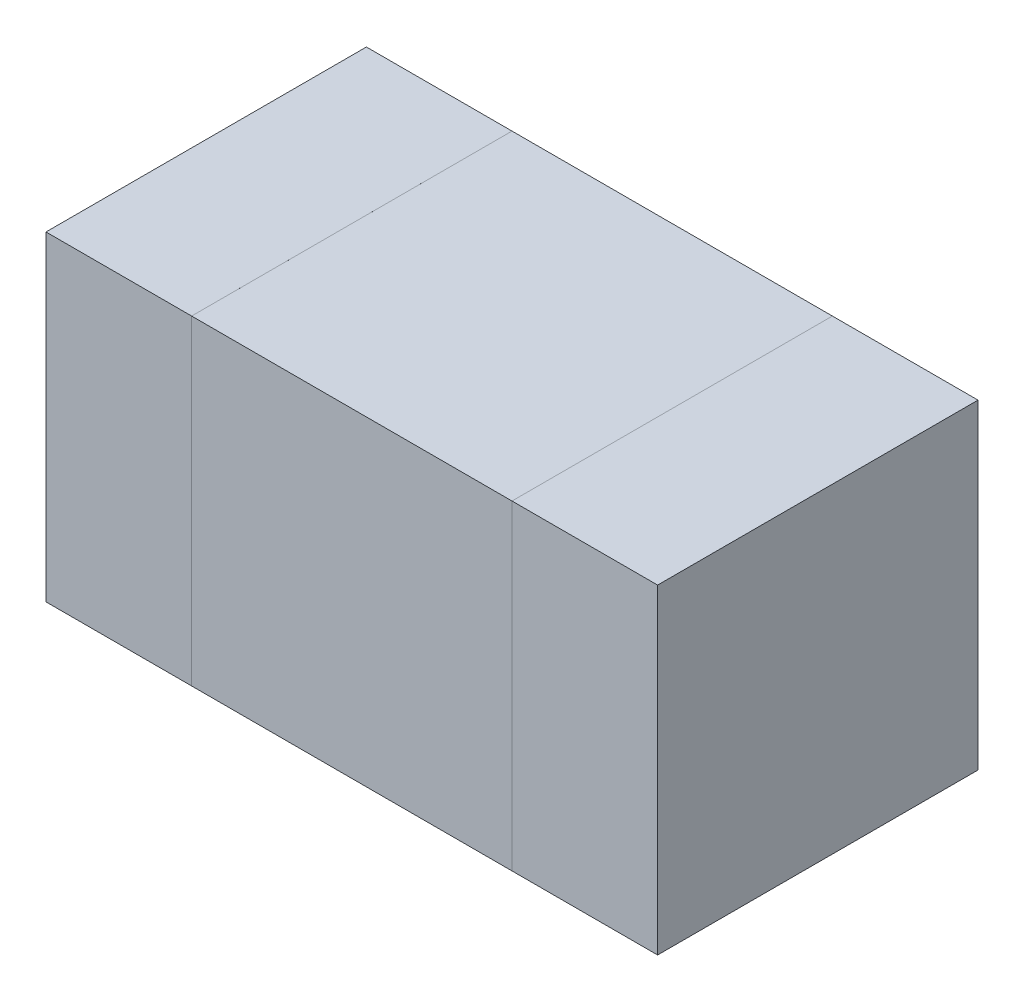
ISO-10303-21;
HEADER;
FILE_DESCRIPTION(('STEP AP214'),'2;1');
FILE_NAME('part.step','',(''),(''),'','','');
FILE_SCHEMA(('AUTOMOTIVE_DESIGN { 1 0 10303 214 1 1 1 1 }'));
ENDSEC;
DATA;
#1=APPLICATION_CONTEXT('core data for automotive mechanical design processes');
#2=APPLICATION_PROTOCOL_DEFINITION('international standard','automotive_design',2000,#1);
#3=PRODUCT_CONTEXT('',#1,'mechanical');
#4=PRODUCT('Part','Part','',(#3));
#5=PRODUCT_RELATED_PRODUCT_CATEGORY('part','',(#4));
#6=PRODUCT_DEFINITION_FORMATION('','',#4);
#7=PRODUCT_DEFINITION_CONTEXT('part definition',#1,'design');
#8=PRODUCT_DEFINITION('design','',#6,#7);
#9=PRODUCT_DEFINITION_SHAPE('','',#8);
#10=(LENGTH_UNIT() NAMED_UNIT(*) SI_UNIT(.MILLI.,.METRE.));
#11=(NAMED_UNIT(*) PLANE_ANGLE_UNIT() SI_UNIT($,.RADIAN.));
#12=(NAMED_UNIT(*) SI_UNIT($,.STERADIAN.) SOLID_ANGLE_UNIT());
#13=UNCERTAINTY_MEASURE_WITH_UNIT(LENGTH_MEASURE(1.E-05),#10,'distance_accuracy_value','');
#14=(GEOMETRIC_REPRESENTATION_CONTEXT(3) GLOBAL_UNCERTAINTY_ASSIGNED_CONTEXT((#13)) GLOBAL_UNIT_ASSIGNED_CONTEXT((#10,
#11,#12)) REPRESENTATION_CONTEXT('',''));
#15=CARTESIAN_POINT('',(0.,0.,0.));
#16=DIRECTION('',(0.,0.,1.));
#17=DIRECTION('',(1.,0.,0.));
#18=AXIS2_PLACEMENT_3D('',#15,#16,#17);
#19=CARTESIAN_POINT('',(1.489995475586,8.609997420195,0.32999934));
#20=DIRECTION('',(0.,0.,-1.));
#21=DIRECTION('',(0.,-1.,0.));
#22=AXIS2_PLACEMENT_3D('',#19,#20,#21);
#23=PLANE('',#22);
#24=DIRECTION('',(0.,1.,0.));
#25=VECTOR('',#24,1.);
#26=CARTESIAN_POINT('',(1.489995475586,8.609997420195,0.32999934));
#27=LINE('',#26,#25);
#28=CARTESIAN_POINT('',(1.489995475586,8.609997420195,0.32999934));
#29=VERTEX_POINT('',#28);
#30=CARTESIAN_POINT('',(1.489995475586,8.939999300195,0.32999934));
#31=VERTEX_POINT('',#30);
#32=EDGE_CURVE('P0_E82',#29,#31,#27,.T.);
#33=ORIENTED_EDGE('',*,*,#32,.T.);
#34=DIRECTION('',(-1.,0.,0.));
#35=VECTOR('',#34,1.);
#36=CARTESIAN_POINT('',(1.489995475586,8.939999300195,0.32999934));
#37=LINE('',#36,#35);
#38=CARTESIAN_POINT('',(1.339993235586,8.939999300195,0.32999934));
#39=VERTEX_POINT('',#38);
#40=EDGE_CURVE('P0_E99',#31,#39,#37,.T.);
#41=ORIENTED_EDGE('',*,*,#40,.T.);
#42=DIRECTION('',(0.,-1.,0.));
#43=VECTOR('',#42,1.);
#44=CARTESIAN_POINT('',(1.339993235586,8.939999300195,0.32999934));
#45=LINE('',#44,#43);
#46=CARTESIAN_POINT('',(1.339993235586,8.609997420195,0.32999934));
#47=VERTEX_POINT('',#46);
#48=EDGE_CURVE('P0_E75',#39,#47,#45,.T.);
#49=ORIENTED_EDGE('',*,*,#48,.T.);
#50=DIRECTION('',(1.,0.,0.));
#51=VECTOR('',#50,1.);
#52=CARTESIAN_POINT('',(1.339993235586,8.609997420195,0.32999934));
#53=LINE('',#52,#51);
#54=EDGE_CURVE('P0_E11',#47,#29,#53,.T.);
#55=ORIENTED_EDGE('',*,*,#54,.T.);
#56=EDGE_LOOP('',(#33,#41,#49,#55));
#57=FACE_BOUND('',#56,.T.);
#58=ADVANCED_FACE('P0_F17',(#57),#23,.F.);
#59=CARTESIAN_POINT('',(1.489995475586,8.609997420195,0.));
#60=DIRECTION('',(0.,0.,-1.));
#61=DIRECTION('',(0.,-1.,0.));
#62=AXIS2_PLACEMENT_3D('',#59,#60,#61);
#63=PLANE('',#62);
#64=DIRECTION('',(1.,0.,0.));
#65=VECTOR('',#64,1.);
#66=CARTESIAN_POINT('',(1.339993235586,8.609997420195,0.));
#67=LINE('',#66,#65);
#68=CARTESIAN_POINT('',(1.339993235586,8.609997420195,0.));
#69=VERTEX_POINT('',#68);
#70=CARTESIAN_POINT('',(1.489995475586,8.609997420195,0.));
#71=VERTEX_POINT('',#70);
#72=EDGE_CURVE('P0_E26',#69,#71,#67,.T.);
#73=ORIENTED_EDGE('',*,*,#72,.F.);
#74=DIRECTION('',(0.,-1.,0.));
#75=VECTOR('',#74,1.);
#76=CARTESIAN_POINT('',(1.339993235586,8.939999300195,0.));
#77=LINE('',#76,#75);
#78=CARTESIAN_POINT('',(1.339993235586,8.939999300195,0.));
#79=VERTEX_POINT('',#78);
#80=EDGE_CURVE('P0_E102',#79,#69,#77,.T.);
#81=ORIENTED_EDGE('',*,*,#80,.F.);
#82=DIRECTION('',(-1.,0.,0.));
#83=VECTOR('',#82,1.);
#84=CARTESIAN_POINT('',(1.489995475586,8.939999300195,0.));
#85=LINE('',#84,#83);
#86=CARTESIAN_POINT('',(1.489995475586,8.939999300195,0.));
#87=VERTEX_POINT('',#86);
#88=EDGE_CURVE('P0_E84',#87,#79,#85,.T.);
#89=ORIENTED_EDGE('',*,*,#88,.F.);
#90=DIRECTION('',(0.,1.,0.));
#91=VECTOR('',#90,1.);
#92=CARTESIAN_POINT('',(1.489995475586,8.609997420195,0.));
#93=LINE('',#92,#91);
#94=EDGE_CURVE('P0_E80',#71,#87,#93,.T.);
#95=ORIENTED_EDGE('',*,*,#94,.F.);
#96=EDGE_LOOP('',(#73,#81,#89,#95));
#97=FACE_BOUND('',#96,.T.);
#98=ADVANCED_FACE('P0_F19',(#97),#63,.T.);
#99=CARTESIAN_POINT('',(1.339993235586,8.609997420195,0.));
#100=DIRECTION('',(0.,1.,0.));
#101=DIRECTION('',(1.,0.,0.));
#102=AXIS2_PLACEMENT_3D('',#99,#100,#101);
#103=PLANE('',#102);
#104=ORIENTED_EDGE('',*,*,#72,.T.);
#105=DIRECTION('',(0.,0.,1.));
#106=VECTOR('',#105,1.);
#107=CARTESIAN_POINT('',(1.489995475586,8.609997420195,0.));
#108=LINE('',#107,#106);
#109=EDGE_CURVE('P0_E69',#71,#29,#108,.T.);
#110=ORIENTED_EDGE('',*,*,#109,.T.);
#111=ORIENTED_EDGE('',*,*,#54,.F.);
#112=DIRECTION('',(0.,0.,1.));
#113=VECTOR('',#112,1.);
#114=CARTESIAN_POINT('',(1.339993235586,8.609997420195,0.));
#115=LINE('',#114,#113);
#116=EDGE_CURVE('P0_E72',#69,#47,#115,.T.);
#117=ORIENTED_EDGE('',*,*,#116,.F.);
#118=EDGE_LOOP('',(#104,#110,#111,#117));
#119=FACE_BOUND('',#118,.T.);
#120=ADVANCED_FACE('P0_F68',(#119),#103,.F.);
#121=CARTESIAN_POINT('',(1.339993235586,8.939999300195,0.));
#122=DIRECTION('',(1.,0.,0.));
#123=DIRECTION('',(0.,1.,0.));
#124=AXIS2_PLACEMENT_3D('',#121,#122,#123);
#125=PLANE('',#124);
#126=ORIENTED_EDGE('',*,*,#80,.T.);
#127=ORIENTED_EDGE('',*,*,#116,.T.);
#128=ORIENTED_EDGE('',*,*,#48,.F.);
#129=DIRECTION('',(0.,0.,1.));
#130=VECTOR('',#129,1.);
#131=CARTESIAN_POINT('',(1.339993235586,8.939999300195,0.));
#132=LINE('',#131,#130);
#133=EDGE_CURVE('P0_E103',#79,#39,#132,.T.);
#134=ORIENTED_EDGE('',*,*,#133,.F.);
#135=EDGE_LOOP('',(#126,#127,#128,#134));
#136=FACE_BOUND('',#135,.T.);
#137=ADVANCED_FACE('P0_F117',(#136),#125,.F.);
#138=CARTESIAN_POINT('',(1.489995475586,8.939999300195,0.));
#139=DIRECTION('',(0.,-1.,0.));
#140=DIRECTION('',(0.,0.,-1.));
#141=AXIS2_PLACEMENT_3D('',#138,#139,#140);
#142=PLANE('',#141);
#143=ORIENTED_EDGE('',*,*,#88,.T.);
#144=ORIENTED_EDGE('',*,*,#133,.T.);
#145=ORIENTED_EDGE('',*,*,#40,.F.);
#146=DIRECTION('',(0.,0.,1.));
#147=VECTOR('',#146,1.);
#148=CARTESIAN_POINT('',(1.489995475586,8.939999300195,0.));
#149=LINE('',#148,#147);
#150=EDGE_CURVE('P0_E89',#87,#31,#149,.T.);
#151=ORIENTED_EDGE('',*,*,#150,.F.);
#152=EDGE_LOOP('',(#143,#144,#145,#151));
#153=FACE_BOUND('',#152,.T.);
#154=ADVANCED_FACE('P0_F120',(#153),#142,.F.);
#155=CARTESIAN_POINT('',(1.489995475586,8.609997420195,0.));
#156=DIRECTION('',(-1.,0.,0.));
#157=DIRECTION('',(0.,0.,1.));
#158=AXIS2_PLACEMENT_3D('',#155,#156,#157);
#159=PLANE('',#158);
#160=ORIENTED_EDGE('',*,*,#94,.T.);
#161=ORIENTED_EDGE('',*,*,#150,.T.);
#162=ORIENTED_EDGE('',*,*,#32,.F.);
#163=ORIENTED_EDGE('',*,*,#109,.F.);
#164=EDGE_LOOP('',(#160,#161,#162,#163));
#165=FACE_BOUND('',#164,.T.);
#166=ADVANCED_FACE('P0_F78',(#165),#159,.F.);
#167=CLOSED_SHELL('',(#58,#98,#120,#137,#154,#166));
#168=MANIFOLD_SOLID_BREP('P0_B1',#167);
#169=CARTESIAN_POINT('',(1.009999748047,8.609997420195,0.32999934));
#170=DIRECTION('',(0.,0.,-1.));
#171=DIRECTION('',(0.,-1.,0.));
#172=AXIS2_PLACEMENT_3D('',#169,#170,#171);
#173=PLANE('',#172);
#174=DIRECTION('',(0.,1.,0.));
#175=VECTOR('',#174,1.);
#176=CARTESIAN_POINT('',(1.009999748047,8.609997420195,0.32999934));
#177=LINE('',#176,#175);
#178=CARTESIAN_POINT('',(1.009999748047,8.609997420195,0.32999934));
#179=VERTEX_POINT('',#178);
#180=CARTESIAN_POINT('',(1.009999748047,8.939999300195,0.32999934));
#181=VERTEX_POINT('',#180);
#182=EDGE_CURVE('P1_E99',#179,#181,#177,.T.);
#183=ORIENTED_EDGE('',*,*,#182,.T.);
#184=DIRECTION('',(-1.,0.,0.));
#185=VECTOR('',#184,1.);
#186=CARTESIAN_POINT('',(1.009999748047,8.939999300195,0.32999934));
#187=LINE('',#186,#185);
#188=CARTESIAN_POINT('',(0.859997508047,8.939999300195,0.32999934));
#189=VERTEX_POINT('',#188);
#190=EDGE_CURVE('P1_E79',#181,#189,#187,.T.);
#191=ORIENTED_EDGE('',*,*,#190,.T.);
#192=DIRECTION('',(0.,-1.,0.));
#193=VECTOR('',#192,1.);
#194=CARTESIAN_POINT('',(0.859997508047,8.939999300195,0.32999934));
#195=LINE('',#194,#193);
#196=CARTESIAN_POINT('',(0.859997508047,8.609997420195,0.32999934));
#197=VERTEX_POINT('',#196);
#198=EDGE_CURVE('P1_E84',#189,#197,#195,.T.);
#199=ORIENTED_EDGE('',*,*,#198,.T.);
#200=DIRECTION('',(1.,0.,0.));
#201=VECTOR('',#200,1.);
#202=CARTESIAN_POINT('',(0.859997508047,8.609997420195,0.32999934));
#203=LINE('',#202,#201);
#204=EDGE_CURVE('P1_E11',#197,#179,#203,.T.);
#205=ORIENTED_EDGE('',*,*,#204,.T.);
#206=EDGE_LOOP('',(#183,#191,#199,#205));
#207=FACE_BOUND('',#206,.T.);
#208=ADVANCED_FACE('P1_F17',(#207),#173,.F.);
#209=CARTESIAN_POINT('',(1.009999748047,8.609997420195,0.));
#210=DIRECTION('',(0.,0.,-1.));
#211=DIRECTION('',(0.,-1.,0.));
#212=AXIS2_PLACEMENT_3D('',#209,#210,#211);
#213=PLANE('',#212);
#214=DIRECTION('',(1.,0.,0.));
#215=VECTOR('',#214,1.);
#216=CARTESIAN_POINT('',(0.859997508047,8.609997420195,0.));
#217=LINE('',#216,#215);
#218=CARTESIAN_POINT('',(0.859997508047,8.609997420195,0.));
#219=VERTEX_POINT('',#218);
#220=CARTESIAN_POINT('',(1.009999748047,8.609997420195,0.));
#221=VERTEX_POINT('',#220);
#222=EDGE_CURVE('P1_E20',#219,#221,#217,.T.);
#223=ORIENTED_EDGE('',*,*,#222,.F.);
#224=DIRECTION('',(0.,-1.,0.));
#225=VECTOR('',#224,1.);
#226=CARTESIAN_POINT('',(0.859997508047,8.939999300195,0.));
#227=LINE('',#226,#225);
#228=CARTESIAN_POINT('',(0.859997508047,8.939999300195,0.));
#229=VERTEX_POINT('',#228);
#230=EDGE_CURVE('P1_E68',#229,#219,#227,.T.);
#231=ORIENTED_EDGE('',*,*,#230,.F.);
#232=DIRECTION('',(-1.,0.,0.));
#233=VECTOR('',#232,1.);
#234=CARTESIAN_POINT('',(1.009999748047,8.939999300195,0.));
#235=LINE('',#234,#233);
#236=CARTESIAN_POINT('',(1.009999748047,8.939999300195,0.));
#237=VERTEX_POINT('',#236);
#238=EDGE_CURVE('P1_E73',#237,#229,#235,.T.);
#239=ORIENTED_EDGE('',*,*,#238,.F.);
#240=DIRECTION('',(0.,1.,0.));
#241=VECTOR('',#240,1.);
#242=CARTESIAN_POINT('',(1.009999748047,8.609997420195,0.));
#243=LINE('',#242,#241);
#244=EDGE_CURVE('P1_E116',#221,#237,#243,.T.);
#245=ORIENTED_EDGE('',*,*,#244,.F.);
#246=EDGE_LOOP('',(#223,#231,#239,#245));
#247=FACE_BOUND('',#246,.T.);
#248=ADVANCED_FACE('P1_F70',(#247),#213,.T.);
#249=CARTESIAN_POINT('',(0.859997508047,8.609997420195,0.));
#250=DIRECTION('',(0.,1.,0.));
#251=DIRECTION('',(1.,0.,0.));
#252=AXIS2_PLACEMENT_3D('',#249,#250,#251);
#253=PLANE('',#252);
#254=ORIENTED_EDGE('',*,*,#222,.T.);
#255=DIRECTION('',(0.,0.,1.));
#256=VECTOR('',#255,1.);
#257=CARTESIAN_POINT('',(1.009999748047,8.609997420195,0.));
#258=LINE('',#257,#256);
#259=EDGE_CURVE('P1_E94',#221,#179,#258,.T.);
#260=ORIENTED_EDGE('',*,*,#259,.T.);
#261=ORIENTED_EDGE('',*,*,#204,.F.);
#262=DIRECTION('',(0.,0.,1.));
#263=VECTOR('',#262,1.);
#264=CARTESIAN_POINT('',(0.859997508047,8.609997420195,0.));
#265=LINE('',#264,#263);
#266=EDGE_CURVE('P1_E78',#219,#197,#265,.T.);
#267=ORIENTED_EDGE('',*,*,#266,.F.);
#268=EDGE_LOOP('',(#254,#260,#261,#267));
#269=FACE_BOUND('',#268,.T.);
#270=ADVANCED_FACE('P1_F112',(#269),#253,.F.);
#271=CARTESIAN_POINT('',(0.859997508047,8.939999300195,0.));
#272=DIRECTION('',(1.,0.,0.));
#273=DIRECTION('',(0.,1.,0.));
#274=AXIS2_PLACEMENT_3D('',#271,#272,#273);
#275=PLANE('',#274);
#276=ORIENTED_EDGE('',*,*,#230,.T.);
#277=ORIENTED_EDGE('',*,*,#266,.T.);
#278=ORIENTED_EDGE('',*,*,#198,.F.);
#279=DIRECTION('',(0.,0.,1.));
#280=VECTOR('',#279,1.);
#281=CARTESIAN_POINT('',(0.859997508047,8.939999300195,0.));
#282=LINE('',#281,#280);
#283=EDGE_CURVE('P1_E82',#229,#189,#282,.T.);
#284=ORIENTED_EDGE('',*,*,#283,.F.);
#285=EDGE_LOOP('',(#276,#277,#278,#284));
#286=FACE_BOUND('',#285,.T.);
#287=ADVANCED_FACE('P1_F83',(#286),#275,.F.);
#288=CARTESIAN_POINT('',(1.009999748047,8.939999300195,0.));
#289=DIRECTION('',(0.,-1.,0.));
#290=DIRECTION('',(0.,0.,-1.));
#291=AXIS2_PLACEMENT_3D('',#288,#289,#290);
#292=PLANE('',#291);
#293=ORIENTED_EDGE('',*,*,#238,.T.);
#294=ORIENTED_EDGE('',*,*,#283,.T.);
#295=ORIENTED_EDGE('',*,*,#190,.F.);
#296=DIRECTION('',(0.,0.,1.));
#297=VECTOR('',#296,1.);
#298=CARTESIAN_POINT('',(1.009999748047,8.939999300195,0.));
#299=LINE('',#298,#297);
#300=EDGE_CURVE('P1_E91',#237,#181,#299,.T.);
#301=ORIENTED_EDGE('',*,*,#300,.F.);
#302=EDGE_LOOP('',(#293,#294,#295,#301));
#303=FACE_BOUND('',#302,.T.);
#304=ADVANCED_FACE('P1_F89',(#303),#292,.F.);
#305=CARTESIAN_POINT('',(1.009999748047,8.609997420195,0.));
#306=DIRECTION('',(-1.,0.,0.));
#307=DIRECTION('',(0.,0.,1.));
#308=AXIS2_PLACEMENT_3D('',#305,#306,#307);
#309=PLANE('',#308);
#310=ORIENTED_EDGE('',*,*,#244,.T.);
#311=ORIENTED_EDGE('',*,*,#300,.T.);
#312=ORIENTED_EDGE('',*,*,#182,.F.);
#313=ORIENTED_EDGE('',*,*,#259,.F.);
#314=EDGE_LOOP('',(#310,#311,#312,#313));
#315=FACE_BOUND('',#314,.T.);
#316=ADVANCED_FACE('P1_F115',(#315),#309,.F.);
#317=CLOSED_SHELL('',(#208,#248,#270,#287,#304,#316));
#318=MANIFOLD_SOLID_BREP('P1_B1',#317);
#319=CARTESIAN_POINT('',(1.010003181211,8.609999960195,0.32999934));
#320=DIRECTION('',(0.,0.,-1.));
#321=DIRECTION('',(0.,-1.,0.));
#322=AXIS2_PLACEMENT_3D('',#319,#320,#321);
#323=PLANE('',#322);
#324=DIRECTION('',(1.,0.,0.));
#325=VECTOR('',#324,1.);
#326=CARTESIAN_POINT('',(1.010003181211,8.609999960195,0.32999934));
#327=LINE('',#326,#325);
#328=CARTESIAN_POINT('',(1.010003181211,8.609999960195,0.32999934));
#329=VERTEX_POINT('',#328);
#330=CARTESIAN_POINT('',(1.340005061211,8.609999960195,0.32999934));
#331=VERTEX_POINT('',#330);
#332=EDGE_CURVE('P2_E83',#329,#331,#327,.T.);
#333=ORIENTED_EDGE('',*,*,#332,.T.);
#334=DIRECTION('',(0.,1.,0.));
#335=VECTOR('',#334,1.);
#336=CARTESIAN_POINT('',(1.340005061211,8.609999960195,0.32999934));
#337=LINE('',#336,#335);
#338=CARTESIAN_POINT('',(1.340005061211,8.939999300195,0.32999934));
#339=VERTEX_POINT('',#338);
#340=EDGE_CURVE('P2_E108',#331,#339,#337,.T.);
#341=ORIENTED_EDGE('',*,*,#340,.T.);
#342=DIRECTION('',(-1.,0.,0.));
#343=VECTOR('',#342,1.);
#344=CARTESIAN_POINT('',(1.340005061211,8.939999300195,0.32999934));
#345=LINE('',#344,#343);
#346=CARTESIAN_POINT('',(1.010003181211,8.939999300195,0.32999934));
#347=VERTEX_POINT('',#346);
#348=EDGE_CURVE('P2_E20',#339,#347,#345,.T.);
#349=ORIENTED_EDGE('',*,*,#348,.T.);
#350=DIRECTION('',(0.,-1.,0.));
#351=VECTOR('',#350,1.);
#352=CARTESIAN_POINT('',(1.010003181211,8.939999300195,0.32999934));
#353=LINE('',#352,#351);
#354=EDGE_CURVE('P2_E11',#347,#329,#353,.T.);
#355=ORIENTED_EDGE('',*,*,#354,.T.);
#356=EDGE_LOOP('',(#333,#341,#349,#355));
#357=FACE_BOUND('',#356,.T.);
#358=ADVANCED_FACE('P2_F17',(#357),#323,.F.);
#359=CARTESIAN_POINT('',(1.010003181211,8.609999960195,0.));
#360=DIRECTION('',(0.,0.,-1.));
#361=DIRECTION('',(0.,-1.,0.));
#362=AXIS2_PLACEMENT_3D('',#359,#360,#361);
#363=PLANE('',#362);
#364=DIRECTION('',(0.,-1.,0.));
#365=VECTOR('',#364,1.);
#366=CARTESIAN_POINT('',(1.010003181211,8.939999300195,0.));
#367=LINE('',#366,#365);
#368=CARTESIAN_POINT('',(1.010003181211,8.939999300195,0.));
#369=VERTEX_POINT('',#368);
#370=CARTESIAN_POINT('',(1.010003181211,8.609999960195,0.));
#371=VERTEX_POINT('',#370);
#372=EDGE_CURVE('P2_E26',#369,#371,#367,.T.);
#373=ORIENTED_EDGE('',*,*,#372,.F.);
#374=DIRECTION('',(-1.,0.,0.));
#375=VECTOR('',#374,1.);
#376=CARTESIAN_POINT('',(1.340005061211,8.939999300195,0.));
#377=LINE('',#376,#375);
#378=CARTESIAN_POINT('',(1.340005061211,8.939999300195,0.));
#379=VERTEX_POINT('',#378);
#380=EDGE_CURVE('P2_E104',#379,#369,#377,.T.);
#381=ORIENTED_EDGE('',*,*,#380,.F.);
#382=DIRECTION('',(0.,1.,0.));
#383=VECTOR('',#382,1.);
#384=CARTESIAN_POINT('',(1.340005061211,8.609999960195,0.));
#385=LINE('',#384,#383);
#386=CARTESIAN_POINT('',(1.340005061211,8.609999960195,0.));
#387=VERTEX_POINT('',#386);
#388=EDGE_CURVE('P2_E85',#387,#379,#385,.T.);
#389=ORIENTED_EDGE('',*,*,#388,.F.);
#390=DIRECTION('',(1.,0.,0.));
#391=VECTOR('',#390,1.);
#392=CARTESIAN_POINT('',(1.010003181211,8.609999960195,0.));
#393=LINE('',#392,#391);
#394=EDGE_CURVE('P2_E81',#371,#387,#393,.T.);
#395=ORIENTED_EDGE('',*,*,#394,.F.);
#396=EDGE_LOOP('',(#373,#381,#389,#395));
#397=FACE_BOUND('',#396,.T.);
#398=ADVANCED_FACE('P2_F87',(#397),#363,.T.);
#399=CARTESIAN_POINT('',(1.010003181211,8.939999300195,0.));
#400=DIRECTION('',(1.,0.,0.));
#401=DIRECTION('',(0.,1.,0.));
#402=AXIS2_PLACEMENT_3D('',#399,#400,#401);
#403=PLANE('',#402);
#404=ORIENTED_EDGE('',*,*,#372,.T.);
#405=DIRECTION('',(0.,0.,1.));
#406=VECTOR('',#405,1.);
#407=CARTESIAN_POINT('',(1.010003181211,8.609999960195,0.));
#408=LINE('',#407,#406);
#409=EDGE_CURVE('P2_E70',#371,#329,#408,.T.);
#410=ORIENTED_EDGE('',*,*,#409,.T.);
#411=ORIENTED_EDGE('',*,*,#354,.F.);
#412=DIRECTION('',(0.,0.,1.));
#413=VECTOR('',#412,1.);
#414=CARTESIAN_POINT('',(1.010003181211,8.939999300195,0.));
#415=LINE('',#414,#413);
#416=EDGE_CURVE('P2_E73',#369,#347,#415,.T.);
#417=ORIENTED_EDGE('',*,*,#416,.F.);
#418=EDGE_LOOP('',(#404,#410,#411,#417));
#419=FACE_BOUND('',#418,.T.);
#420=ADVANCED_FACE('P2_F69',(#419),#403,.F.);
#421=CARTESIAN_POINT('',(1.340005061211,8.939999300195,0.));
#422=DIRECTION('',(0.,-1.,0.));
#423=DIRECTION('',(0.,0.,-1.));
#424=AXIS2_PLACEMENT_3D('',#421,#422,#423);
#425=PLANE('',#424);
#426=ORIENTED_EDGE('',*,*,#380,.T.);
#427=ORIENTED_EDGE('',*,*,#416,.T.);
#428=ORIENTED_EDGE('',*,*,#348,.F.);
#429=DIRECTION('',(0.,0.,1.));
#430=VECTOR('',#429,1.);
#431=CARTESIAN_POINT('',(1.340005061211,8.939999300195,0.));
#432=LINE('',#431,#430);
#433=EDGE_CURVE('P2_E98',#379,#339,#432,.T.);
#434=ORIENTED_EDGE('',*,*,#433,.F.);
#435=EDGE_LOOP('',(#426,#427,#428,#434));
#436=FACE_BOUND('',#435,.T.);
#437=ADVANCED_FACE('P2_F116',(#436),#425,.F.);
#438=CARTESIAN_POINT('',(1.340005061211,8.609999960195,0.));
#439=DIRECTION('',(-1.,0.,0.));
#440=DIRECTION('',(0.,0.,1.));
#441=AXIS2_PLACEMENT_3D('',#438,#439,#440);
#442=PLANE('',#441);
#443=ORIENTED_EDGE('',*,*,#388,.T.);
#444=ORIENTED_EDGE('',*,*,#433,.T.);
#445=ORIENTED_EDGE('',*,*,#340,.F.);
#446=DIRECTION('',(0.,0.,1.));
#447=VECTOR('',#446,1.);
#448=CARTESIAN_POINT('',(1.340005061211,8.609999960195,0.));
#449=LINE('',#448,#447);
#450=EDGE_CURVE('P2_E91',#387,#331,#449,.T.);
#451=ORIENTED_EDGE('',*,*,#450,.F.);
#452=EDGE_LOOP('',(#443,#444,#445,#451));
#453=FACE_BOUND('',#452,.T.);
#454=ADVANCED_FACE('P2_F118',(#453),#442,.F.);
#455=CARTESIAN_POINT('',(1.010003181211,8.609999960195,0.));
#456=DIRECTION('',(0.,1.,0.));
#457=DIRECTION('',(1.,0.,0.));
#458=AXIS2_PLACEMENT_3D('',#455,#456,#457);
#459=PLANE('',#458);
#460=ORIENTED_EDGE('',*,*,#394,.T.);
#461=ORIENTED_EDGE('',*,*,#450,.T.);
#462=ORIENTED_EDGE('',*,*,#332,.F.);
#463=ORIENTED_EDGE('',*,*,#409,.F.);
#464=EDGE_LOOP('',(#460,#461,#462,#463));
#465=FACE_BOUND('',#464,.T.);
#466=ADVANCED_FACE('P2_F79',(#465),#459,.F.);
#467=CLOSED_SHELL('',(#358,#398,#420,#437,#454,#466));
#468=MANIFOLD_SOLID_BREP('P2_B1',#467);
#469=ADVANCED_BREP_SHAPE_REPRESENTATION('',(#18,#168,#318,#468),#14);
#470=SHAPE_DEFINITION_REPRESENTATION(#9,#469);
ENDSEC;
END-ISO-10303-21;
